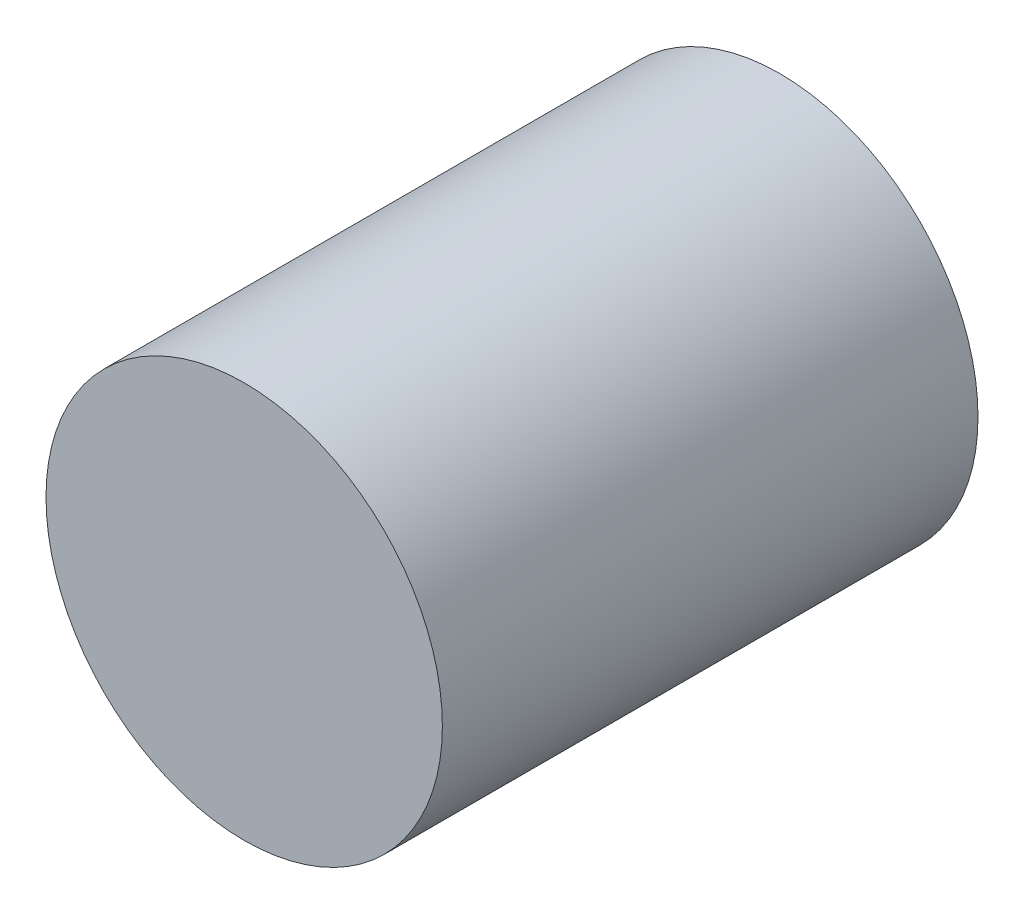
ISO-10303-21;
HEADER;
FILE_DESCRIPTION(('STEP AP214'),'2;1');
FILE_NAME('part.step','',(''),(''),'','','');
FILE_SCHEMA(('AUTOMOTIVE_DESIGN { 1 0 10303 214 1 1 1 1 }'));
ENDSEC;
DATA;
#1=APPLICATION_CONTEXT('core data for automotive mechanical design processes');
#2=APPLICATION_PROTOCOL_DEFINITION('international standard','automotive_design',2000,#1);
#3=PRODUCT_CONTEXT('',#1,'mechanical');
#4=PRODUCT('Part','Part','',(#3));
#5=PRODUCT_RELATED_PRODUCT_CATEGORY('part','',(#4));
#6=PRODUCT_DEFINITION_FORMATION('','',#4);
#7=PRODUCT_DEFINITION_CONTEXT('part definition',#1,'design');
#8=PRODUCT_DEFINITION('design','',#6,#7);
#9=PRODUCT_DEFINITION_SHAPE('','',#8);
#10=(LENGTH_UNIT() NAMED_UNIT(*) SI_UNIT(.MILLI.,.METRE.));
#11=(NAMED_UNIT(*) PLANE_ANGLE_UNIT() SI_UNIT($,.RADIAN.));
#12=(NAMED_UNIT(*) SI_UNIT($,.STERADIAN.) SOLID_ANGLE_UNIT());
#13=UNCERTAINTY_MEASURE_WITH_UNIT(LENGTH_MEASURE(1.E-05),#10,'distance_accuracy_value','');
#14=(GEOMETRIC_REPRESENTATION_CONTEXT(3) GLOBAL_UNCERTAINTY_ASSIGNED_CONTEXT((#13)) GLOBAL_UNIT_ASSIGNED_CONTEXT((#10,
#11,#12)) REPRESENTATION_CONTEXT('',''));
#15=CARTESIAN_POINT('',(0.,0.,0.));
#16=DIRECTION('',(0.,0.,1.));
#17=DIRECTION('',(1.,0.,0.));
#18=AXIS2_PLACEMENT_3D('',#15,#16,#17);
#19=CARTESIAN_POINT('',(0.,0.,10.4775));
#20=DIRECTION('',(0.,0.,-1.));
#21=DIRECTION('',(-1.,0.,0.));
#22=AXIS2_PLACEMENT_3D('',#19,#20,#21);
#23=CYLINDRICAL_SURFACE('',#22,3.05435);
#24=CARTESIAN_POINT('',(0.,0.,10.4775));
#25=DIRECTION('',(0.,0.,1.));
#26=DIRECTION('',(1.,0.,0.));
#27=AXIS2_PLACEMENT_3D('',#24,#25,#26);
#28=CIRCLE('',#27,3.05435);
#29=CARTESIAN_POINT('',(3.05435,0.,10.4775));
#30=VERTEX_POINT('',#29);
#31=EDGE_CURVE('E10',#30,#30,#28,.T.);
#32=ORIENTED_EDGE('',*,*,#31,.F.);
#33=EDGE_LOOP('',(#32));
#34=FACE_BOUND('',#33,.T.);
#35=CARTESIAN_POINT('',(0.,0.,2.2225));
#36=DIRECTION('',(0.,0.,1.));
#37=DIRECTION('',(1.,0.,0.));
#38=AXIS2_PLACEMENT_3D('',#35,#36,#37);
#39=CIRCLE('',#38,3.05435);
#40=CARTESIAN_POINT('',(3.05435,0.,2.2225));
#41=VERTEX_POINT('',#40);
#42=EDGE_CURVE('E43',#41,#41,#39,.T.);
#43=ORIENTED_EDGE('',*,*,#42,.T.);
#44=EDGE_LOOP('',(#43));
#45=FACE_BOUND('',#44,.T.);
#46=ADVANCED_FACE('F40',(#34,#45),#23,.T.);
#47=CARTESIAN_POINT('',(0.,0.,10.4775));
#48=DIRECTION('',(0.,0.,1.));
#49=DIRECTION('',(1.,0.,0.));
#50=AXIS2_PLACEMENT_3D('',#47,#48,#49);
#51=PLANE('',#50);
#52=ORIENTED_EDGE('',*,*,#31,.T.);
#53=EDGE_LOOP('',(#52));
#54=FACE_BOUND('',#53,.T.);
#55=ADVANCED_FACE('F57',(#54),#51,.T.);
#56=CARTESIAN_POINT('',(0.,0.,2.2225));
#57=DIRECTION('',(0.,0.,1.));
#58=DIRECTION('',(1.,0.,0.));
#59=AXIS2_PLACEMENT_3D('',#56,#57,#58);
#60=PLANE('',#59);
#61=ORIENTED_EDGE('',*,*,#42,.F.);
#62=EDGE_LOOP('',(#61));
#63=FACE_BOUND('',#62,.T.);
#64=ADVANCED_FACE('F55',(#63),#60,.F.);
#65=CLOSED_SHELL('',(#46,#55,#64));
#66=MANIFOLD_SOLID_BREP('B2',#65);
#67=ADVANCED_BREP_SHAPE_REPRESENTATION('',(#18,#66),#14);
#68=SHAPE_DEFINITION_REPRESENTATION(#9,#67);
ENDSEC;
END-ISO-10303-21;
